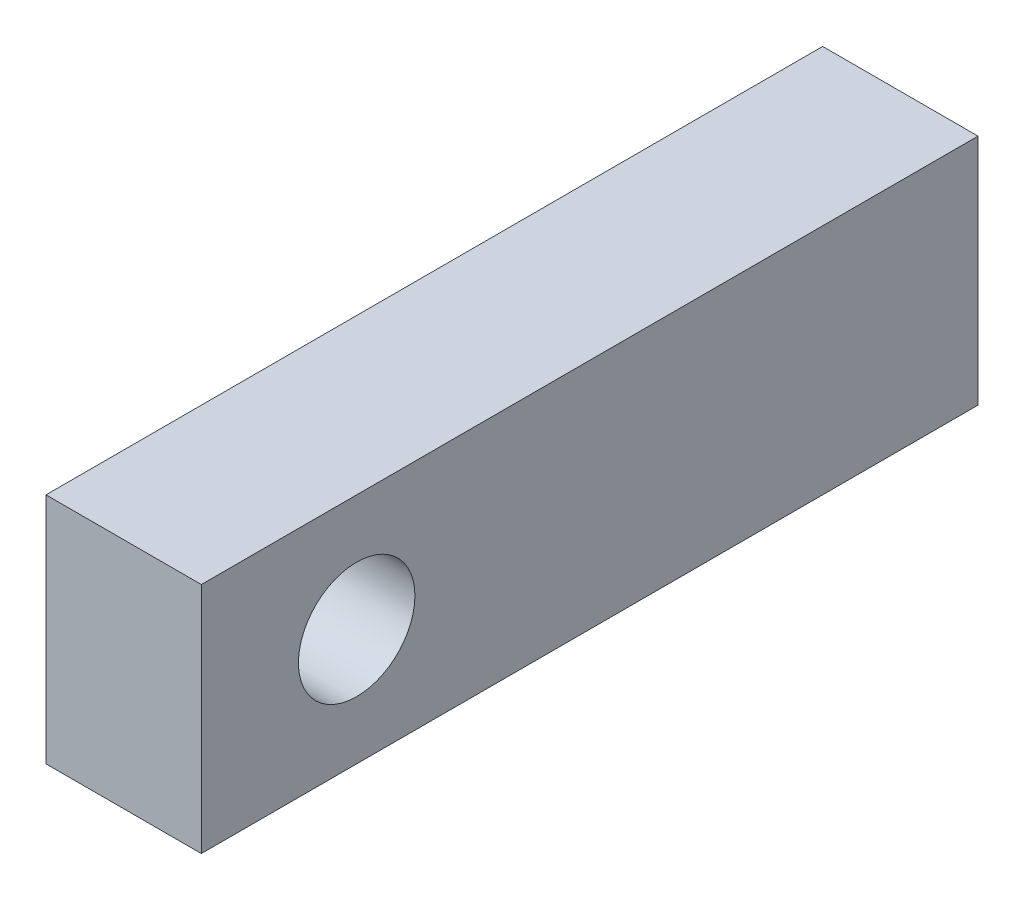
ISO-10303-21;
HEADER;
FILE_DESCRIPTION(('STEP AP214'),'2;1');
FILE_NAME('part.step','',(''),(''),'','','');
FILE_SCHEMA(('AUTOMOTIVE_DESIGN { 1 0 10303 214 1 1 1 1 }'));
ENDSEC;
DATA;
#1=APPLICATION_CONTEXT('core data for automotive mechanical design processes');
#2=APPLICATION_PROTOCOL_DEFINITION('international standard','automotive_design',2000,#1);
#3=PRODUCT_CONTEXT('',#1,'mechanical');
#4=PRODUCT('Part','Part','',(#3));
#5=PRODUCT_RELATED_PRODUCT_CATEGORY('part','',(#4));
#6=PRODUCT_DEFINITION_FORMATION('','',#4);
#7=PRODUCT_DEFINITION_CONTEXT('part definition',#1,'design');
#8=PRODUCT_DEFINITION('design','',#6,#7);
#9=PRODUCT_DEFINITION_SHAPE('','',#8);
#10=(LENGTH_UNIT() NAMED_UNIT(*) SI_UNIT(.MILLI.,.METRE.));
#11=(NAMED_UNIT(*) PLANE_ANGLE_UNIT() SI_UNIT($,.RADIAN.));
#12=(NAMED_UNIT(*) SI_UNIT($,.STERADIAN.) SOLID_ANGLE_UNIT());
#13=UNCERTAINTY_MEASURE_WITH_UNIT(LENGTH_MEASURE(1.E-05),#10,'distance_accuracy_value','');
#14=(GEOMETRIC_REPRESENTATION_CONTEXT(3) GLOBAL_UNCERTAINTY_ASSIGNED_CONTEXT((#13)) GLOBAL_UNIT_ASSIGNED_CONTEXT((#10,
#11,#12)) REPRESENTATION_CONTEXT('',''));
#15=CARTESIAN_POINT('',(0.,0.,0.));
#16=DIRECTION('',(0.,0.,1.));
#17=DIRECTION('',(1.,0.,0.));
#18=AXIS2_PLACEMENT_3D('',#15,#16,#17);
#19=CARTESIAN_POINT('',(0.,0.,127.));
#20=DIRECTION('',(1.,0.,0.));
#21=DIRECTION('',(0.,0.,-1.));
#22=AXIS2_PLACEMENT_3D('',#19,#20,#21);
#23=PLANE('',#22);
#24=CARTESIAN_POINT('',(0.,19.05,101.6));
#25=DIRECTION('',(1.,0.,0.));
#26=DIRECTION('',(0.,0.,-1.));
#27=AXIS2_PLACEMENT_3D('',#24,#25,#26);
#28=CIRCLE('',#27,9.52500000000001);
#29=CARTESIAN_POINT('',(0.,19.05,92.075));
#30=VERTEX_POINT('',#29);
#31=EDGE_CURVE('E100',#30,#30,#28,.T.);
#32=ORIENTED_EDGE('',*,*,#31,.T.);
#33=EDGE_LOOP('',(#32));
#34=FACE_BOUND('',#33,.T.);
#35=DIRECTION('',(0.,-1.,0.));
#36=VECTOR('',#35,1.);
#37=CARTESIAN_POINT('',(0.,0.,0.));
#38=LINE('',#37,#36);
#39=CARTESIAN_POINT('',(0.,38.1,0.));
#40=VERTEX_POINT('',#39);
#41=CARTESIAN_POINT('',(0.,0.,0.));
#42=VERTEX_POINT('',#41);
#43=EDGE_CURVE('E97',#40,#42,#38,.T.);
#44=ORIENTED_EDGE('',*,*,#43,.T.);
#45=DIRECTION('',(0.,0.,-1.));
#46=VECTOR('',#45,1.);
#47=CARTESIAN_POINT('',(0.,0.,127.));
#48=LINE('',#47,#46);
#49=CARTESIAN_POINT('',(0.,0.,127.));
#50=VERTEX_POINT('',#49);
#51=EDGE_CURVE('E11',#50,#42,#48,.T.);
#52=ORIENTED_EDGE('',*,*,#51,.F.);
#53=DIRECTION('',(0.,-1.,0.));
#54=VECTOR('',#53,1.);
#55=CARTESIAN_POINT('',(0.,0.,127.));
#56=LINE('',#55,#54);
#57=CARTESIAN_POINT('',(0.,38.1,127.));
#58=VERTEX_POINT('',#57);
#59=EDGE_CURVE('E85',#58,#50,#56,.T.);
#60=ORIENTED_EDGE('',*,*,#59,.F.);
#61=DIRECTION('',(0.,0.,-1.));
#62=VECTOR('',#61,1.);
#63=CARTESIAN_POINT('',(0.,38.1,127.));
#64=LINE('',#63,#62);
#65=EDGE_CURVE('E93',#58,#40,#64,.T.);
#66=ORIENTED_EDGE('',*,*,#65,.T.);
#67=EDGE_LOOP('',(#44,#52,#60,#66));
#68=FACE_BOUND('',#67,.T.);
#69=ADVANCED_FACE('F34',(#34,#68),#23,.F.);
#70=CARTESIAN_POINT('',(0.,0.,127.));
#71=DIRECTION('',(0.,1.,0.));
#72=DIRECTION('',(0.,0.,1.));
#73=AXIS2_PLACEMENT_3D('',#70,#71,#72);
#74=PLANE('',#73);
#75=DIRECTION('',(1.,0.,0.));
#76=VECTOR('',#75,1.);
#77=CARTESIAN_POINT('',(0.,0.,0.));
#78=LINE('',#77,#76);
#79=CARTESIAN_POINT('',(25.4,0.,0.));
#80=VERTEX_POINT('',#79);
#81=EDGE_CURVE('E89',#42,#80,#78,.T.);
#82=ORIENTED_EDGE('',*,*,#81,.T.);
#83=DIRECTION('',(0.,0.,-1.));
#84=VECTOR('',#83,1.);
#85=CARTESIAN_POINT('',(25.4,0.,127.));
#86=LINE('',#85,#84);
#87=CARTESIAN_POINT('',(25.4,0.,127.));
#88=VERTEX_POINT('',#87);
#89=EDGE_CURVE('E42',#88,#80,#86,.T.);
#90=ORIENTED_EDGE('',*,*,#89,.F.);
#91=DIRECTION('',(1.,0.,0.));
#92=VECTOR('',#91,1.);
#93=CARTESIAN_POINT('',(0.,0.,127.));
#94=LINE('',#93,#92);
#95=EDGE_CURVE('E80',#50,#88,#94,.T.);
#96=ORIENTED_EDGE('',*,*,#95,.F.);
#97=ORIENTED_EDGE('',*,*,#51,.T.);
#98=EDGE_LOOP('',(#82,#90,#96,#97));
#99=FACE_BOUND('',#98,.T.);
#100=ADVANCED_FACE('F88',(#99),#74,.F.);
#101=CARTESIAN_POINT('',(25.4,0.,127.));
#102=DIRECTION('',(-1.,0.,0.));
#103=DIRECTION('',(0.,0.,1.));
#104=AXIS2_PLACEMENT_3D('',#101,#102,#103);
#105=PLANE('',#104);
#106=CARTESIAN_POINT('',(25.4,19.05,101.6));
#107=DIRECTION('',(1.,0.,0.));
#108=DIRECTION('',(0.,0.,-1.));
#109=AXIS2_PLACEMENT_3D('',#106,#107,#108);
#110=CIRCLE('',#109,9.52500000000001);
#111=CARTESIAN_POINT('',(25.4,19.05,92.075));
#112=VERTEX_POINT('',#111);
#113=EDGE_CURVE('E111',#112,#112,#110,.T.);
#114=ORIENTED_EDGE('',*,*,#113,.F.);
#115=EDGE_LOOP('',(#114));
#116=FACE_BOUND('',#115,.T.);
#117=DIRECTION('',(0.,1.,0.));
#118=VECTOR('',#117,1.);
#119=CARTESIAN_POINT('',(25.4,0.,0.));
#120=LINE('',#119,#118);
#121=CARTESIAN_POINT('',(25.4,38.1,0.));
#122=VERTEX_POINT('',#121);
#123=EDGE_CURVE('E67',#80,#122,#120,.T.);
#124=ORIENTED_EDGE('',*,*,#123,.T.);
#125=DIRECTION('',(0.,0.,-1.));
#126=VECTOR('',#125,1.);
#127=CARTESIAN_POINT('',(25.4,38.1,127.));
#128=LINE('',#127,#126);
#129=CARTESIAN_POINT('',(25.4,38.1,127.));
#130=VERTEX_POINT('',#129);
#131=EDGE_CURVE('E90',#130,#122,#128,.T.);
#132=ORIENTED_EDGE('',*,*,#131,.F.);
#133=DIRECTION('',(0.,1.,0.));
#134=VECTOR('',#133,1.);
#135=CARTESIAN_POINT('',(25.4,0.,127.));
#136=LINE('',#135,#134);
#137=EDGE_CURVE('E83',#88,#130,#136,.T.);
#138=ORIENTED_EDGE('',*,*,#137,.F.);
#139=ORIENTED_EDGE('',*,*,#89,.T.);
#140=EDGE_LOOP('',(#124,#132,#138,#139));
#141=FACE_BOUND('',#140,.T.);
#142=ADVANCED_FACE('F91',(#116,#141),#105,.F.);
#143=CARTESIAN_POINT('',(0.,38.1,127.));
#144=DIRECTION('',(0.,-1.,0.));
#145=DIRECTION('',(0.,0.,-1.));
#146=AXIS2_PLACEMENT_3D('',#143,#144,#145);
#147=PLANE('',#146);
#148=DIRECTION('',(-1.,0.,0.));
#149=VECTOR('',#148,1.);
#150=CARTESIAN_POINT('',(0.,38.1,0.));
#151=LINE('',#150,#149);
#152=EDGE_CURVE('E73',#122,#40,#151,.T.);
#153=ORIENTED_EDGE('',*,*,#152,.T.);
#154=ORIENTED_EDGE('',*,*,#65,.F.);
#155=DIRECTION('',(-1.,0.,0.));
#156=VECTOR('',#155,1.);
#157=CARTESIAN_POINT('',(0.,38.1,127.));
#158=LINE('',#157,#156);
#159=EDGE_CURVE('E50',#130,#58,#158,.T.);
#160=ORIENTED_EDGE('',*,*,#159,.F.);
#161=ORIENTED_EDGE('',*,*,#131,.T.);
#162=EDGE_LOOP('',(#153,#154,#160,#161));
#163=FACE_BOUND('',#162,.T.);
#164=ADVANCED_FACE('F105',(#163),#147,.F.);
#165=CARTESIAN_POINT('',(0.,0.,127.));
#166=DIRECTION('',(0.,0.,-1.));
#167=DIRECTION('',(-1.,0.,0.));
#168=AXIS2_PLACEMENT_3D('',#165,#166,#167);
#169=PLANE('',#168);
#170=ORIENTED_EDGE('',*,*,#59,.T.);
#171=ORIENTED_EDGE('',*,*,#95,.T.);
#172=ORIENTED_EDGE('',*,*,#137,.T.);
#173=ORIENTED_EDGE('',*,*,#159,.T.);
#174=EDGE_LOOP('',(#170,#171,#172,#173));
#175=FACE_BOUND('',#174,.T.);
#176=ADVANCED_FACE('F81',(#175),#169,.F.);
#177=CARTESIAN_POINT('',(0.,0.,0.));
#178=DIRECTION('',(0.,0.,-1.));
#179=DIRECTION('',(-1.,0.,0.));
#180=AXIS2_PLACEMENT_3D('',#177,#178,#179);
#181=PLANE('',#180);
#182=ORIENTED_EDGE('',*,*,#43,.F.);
#183=ORIENTED_EDGE('',*,*,#152,.F.);
#184=ORIENTED_EDGE('',*,*,#123,.F.);
#185=ORIENTED_EDGE('',*,*,#81,.F.);
#186=EDGE_LOOP('',(#182,#183,#184,#185));
#187=FACE_BOUND('',#186,.T.);
#188=ADVANCED_FACE('F108',(#187),#181,.T.);
#189=CARTESIAN_POINT('',(0.,19.05,101.6));
#190=DIRECTION('',(1.,0.,0.));
#191=DIRECTION('',(0.,0.,-1.));
#192=AXIS2_PLACEMENT_3D('',#189,#190,#191);
#193=CYLINDRICAL_SURFACE('',#192,9.52500000000001);
#194=ORIENTED_EDGE('',*,*,#31,.F.);
#195=EDGE_LOOP('',(#194));
#196=FACE_BOUND('',#195,.T.);
#197=ORIENTED_EDGE('',*,*,#113,.T.);
#198=EDGE_LOOP('',(#197));
#199=FACE_BOUND('',#198,.T.);
#200=ADVANCED_FACE('F118',(#196,#199),#193,.F.);
#201=CLOSED_SHELL('',(#69,#100,#142,#164,#176,#188,#200));
#202=MANIFOLD_SOLID_BREP('B2',#201);
#203=ADVANCED_BREP_SHAPE_REPRESENTATION('',(#18,#202),#14);
#204=SHAPE_DEFINITION_REPRESENTATION(#9,#203);
ENDSEC;
END-ISO-10303-21;
